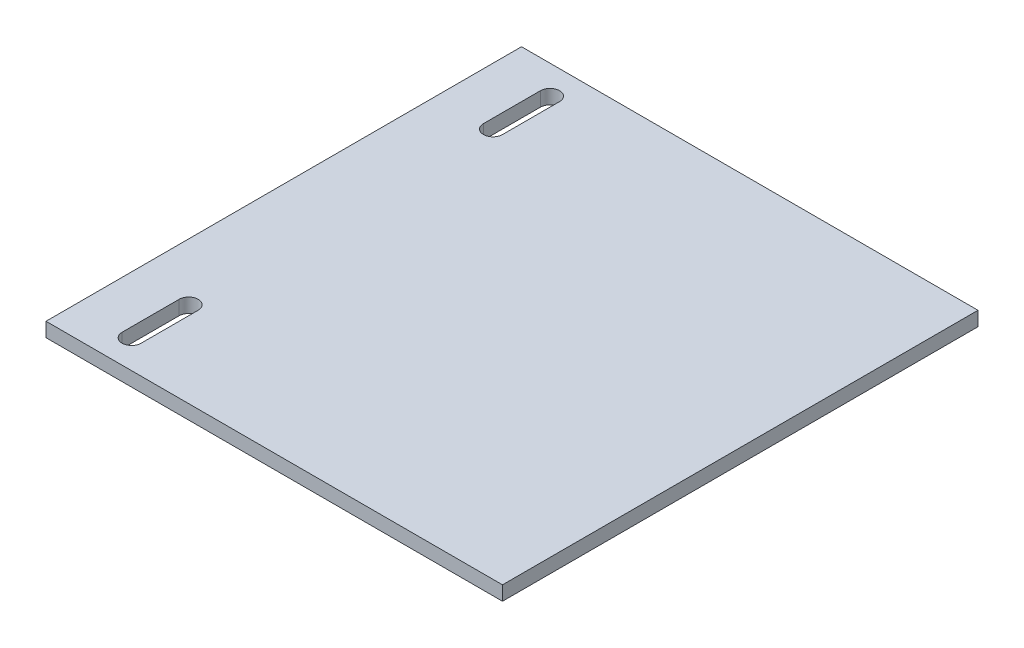
ISO-10303-21;
HEADER;
FILE_DESCRIPTION(('STEP AP214'),'2;1');
FILE_NAME('part.step','',(''),(''),'','','');
FILE_SCHEMA(('AUTOMOTIVE_DESIGN { 1 0 10303 214 1 1 1 1 }'));
ENDSEC;
DATA;
#1=APPLICATION_CONTEXT('core data for automotive mechanical design processes');
#2=APPLICATION_PROTOCOL_DEFINITION('international standard','automotive_design',2000,#1);
#3=PRODUCT_CONTEXT('',#1,'mechanical');
#4=PRODUCT('Part','Part','',(#3));
#5=PRODUCT_RELATED_PRODUCT_CATEGORY('part','',(#4));
#6=PRODUCT_DEFINITION_FORMATION('','',#4);
#7=PRODUCT_DEFINITION_CONTEXT('part definition',#1,'design');
#8=PRODUCT_DEFINITION('design','',#6,#7);
#9=PRODUCT_DEFINITION_SHAPE('','',#8);
#10=(LENGTH_UNIT() NAMED_UNIT(*) SI_UNIT(.MILLI.,.METRE.));
#11=(NAMED_UNIT(*) PLANE_ANGLE_UNIT() SI_UNIT($,.RADIAN.));
#12=(NAMED_UNIT(*) SI_UNIT($,.STERADIAN.) SOLID_ANGLE_UNIT());
#13=UNCERTAINTY_MEASURE_WITH_UNIT(LENGTH_MEASURE(1.E-05),#10,'distance_accuracy_value','');
#14=(GEOMETRIC_REPRESENTATION_CONTEXT(3) GLOBAL_UNCERTAINTY_ASSIGNED_CONTEXT((#13)) GLOBAL_UNIT_ASSIGNED_CONTEXT((#10,
#11,#12)) REPRESENTATION_CONTEXT('',''));
#15=CARTESIAN_POINT('',(0.,0.,0.));
#16=DIRECTION('',(0.,0.,1.));
#17=DIRECTION('',(1.,0.,0.));
#18=AXIS2_PLACEMENT_3D('',#15,#16,#17);
#19=CARTESIAN_POINT('',(-76.2,4.7625,-79.375));
#20=DIRECTION('',(1.,0.,0.));
#21=DIRECTION('',(0.,0.,-1.));
#22=AXIS2_PLACEMENT_3D('',#19,#20,#21);
#23=PLANE('',#22);
#24=DIRECTION('',(0.,0.,1.));
#25=VECTOR('',#24,1.);
#26=CARTESIAN_POINT('',(-76.2,0.,-79.375));
#27=LINE('',#26,#25);
#28=CARTESIAN_POINT('',(-76.2,0.,-79.375));
#29=VERTEX_POINT('',#28);
#30=CARTESIAN_POINT('',(-76.2,0.,79.375));
#31=VERTEX_POINT('',#30);
#32=EDGE_CURVE('E209',#29,#31,#27,.T.);
#33=ORIENTED_EDGE('',*,*,#32,.T.);
#34=DIRECTION('',(0.,-1.,0.));
#35=VECTOR('',#34,1.);
#36=CARTESIAN_POINT('',(-76.2,4.7625,79.375));
#37=LINE('',#36,#35);
#38=CARTESIAN_POINT('',(-76.2,4.7625,79.375));
#39=VERTEX_POINT('',#38);
#40=EDGE_CURVE('E11',#39,#31,#37,.T.);
#41=ORIENTED_EDGE('',*,*,#40,.F.);
#42=DIRECTION('',(0.,0.,1.));
#43=VECTOR('',#42,1.);
#44=CARTESIAN_POINT('',(-76.2,4.7625,-79.375));
#45=LINE('',#44,#43);
#46=CARTESIAN_POINT('',(-76.2,4.7625,-79.375));
#47=VERTEX_POINT('',#46);
#48=EDGE_CURVE('E219',#47,#39,#45,.T.);
#49=ORIENTED_EDGE('',*,*,#48,.F.);
#50=DIRECTION('',(0.,-1.,0.));
#51=VECTOR('',#50,1.);
#52=CARTESIAN_POINT('',(-76.2,4.7625,-79.375));
#53=LINE('',#52,#51);
#54=EDGE_CURVE('E233',#47,#29,#53,.T.);
#55=ORIENTED_EDGE('',*,*,#54,.T.);
#56=EDGE_LOOP('',(#33,#41,#49,#55));
#57=FACE_BOUND('',#56,.T.);
#58=ADVANCED_FACE('F41',(#57),#23,.F.);
#59=CARTESIAN_POINT('',(76.2,4.7625,79.375));
#60=DIRECTION('',(0.,0.,-1.));
#61=DIRECTION('',(-1.,0.,0.));
#62=AXIS2_PLACEMENT_3D('',#59,#60,#61);
#63=PLANE('',#62);
#64=DIRECTION('',(1.,0.,0.));
#65=VECTOR('',#64,1.);
#66=CARTESIAN_POINT('',(76.2,0.,79.375));
#67=LINE('',#66,#65);
#68=CARTESIAN_POINT('',(76.2,0.,79.375));
#69=VERTEX_POINT('',#68);
#70=EDGE_CURVE('E237',#31,#69,#67,.T.);
#71=ORIENTED_EDGE('',*,*,#70,.T.);
#72=DIRECTION('',(0.,-1.,0.));
#73=VECTOR('',#72,1.);
#74=CARTESIAN_POINT('',(76.2,4.7625,79.375));
#75=LINE('',#74,#73);
#76=CARTESIAN_POINT('',(76.2,4.7625,79.375));
#77=VERTEX_POINT('',#76);
#78=EDGE_CURVE('E48',#77,#69,#75,.T.);
#79=ORIENTED_EDGE('',*,*,#78,.F.);
#80=DIRECTION('',(1.,0.,0.));
#81=VECTOR('',#80,1.);
#82=CARTESIAN_POINT('',(76.2,4.7625,79.375));
#83=LINE('',#82,#81);
#84=EDGE_CURVE('E223',#39,#77,#83,.T.);
#85=ORIENTED_EDGE('',*,*,#84,.F.);
#86=ORIENTED_EDGE('',*,*,#40,.T.);
#87=EDGE_LOOP('',(#71,#79,#85,#86));
#88=FACE_BOUND('',#87,.T.);
#89=ADVANCED_FACE('F269',(#88),#63,.F.);
#90=CARTESIAN_POINT('',(76.2,4.7625,-79.375));
#91=DIRECTION('',(-1.,0.,0.));
#92=DIRECTION('',(0.,0.,1.));
#93=AXIS2_PLACEMENT_3D('',#90,#91,#92);
#94=PLANE('',#93);
#95=DIRECTION('',(0.,0.,-1.));
#96=VECTOR('',#95,1.);
#97=CARTESIAN_POINT('',(76.2,0.,-79.375));
#98=LINE('',#97,#96);
#99=CARTESIAN_POINT('',(76.2,0.,-79.375));
#100=VERTEX_POINT('',#99);
#101=EDGE_CURVE('E239',#69,#100,#98,.T.);
#102=ORIENTED_EDGE('',*,*,#101,.T.);
#103=DIRECTION('',(0.,-1.,0.));
#104=VECTOR('',#103,1.);
#105=CARTESIAN_POINT('',(76.2,4.7625,-79.375));
#106=LINE('',#105,#104);
#107=CARTESIAN_POINT('',(76.2,4.7625,-79.375));
#108=VERTEX_POINT('',#107);
#109=EDGE_CURVE('E247',#108,#100,#106,.T.);
#110=ORIENTED_EDGE('',*,*,#109,.F.);
#111=DIRECTION('',(0.,0.,-1.));
#112=VECTOR('',#111,1.);
#113=CARTESIAN_POINT('',(76.2,4.7625,-79.375));
#114=LINE('',#113,#112);
#115=EDGE_CURVE('E227',#77,#108,#114,.T.);
#116=ORIENTED_EDGE('',*,*,#115,.F.);
#117=ORIENTED_EDGE('',*,*,#78,.T.);
#118=EDGE_LOOP('',(#102,#110,#116,#117));
#119=FACE_BOUND('',#118,.T.);
#120=ADVANCED_FACE('F254',(#119),#94,.F.);
#121=CARTESIAN_POINT('',(76.2,4.7625,-79.375));
#122=DIRECTION('',(0.,0.,1.));
#123=DIRECTION('',(1.,0.,0.));
#124=AXIS2_PLACEMENT_3D('',#121,#122,#123);
#125=PLANE('',#124);
#126=DIRECTION('',(-1.,0.,0.));
#127=VECTOR('',#126,1.);
#128=CARTESIAN_POINT('',(76.2,0.,-79.375));
#129=LINE('',#128,#127);
#130=EDGE_CURVE('E224',#100,#29,#129,.T.);
#131=ORIENTED_EDGE('',*,*,#130,.T.);
#132=ORIENTED_EDGE('',*,*,#54,.F.);
#133=DIRECTION('',(-1.,0.,0.));
#134=VECTOR('',#133,1.);
#135=CARTESIAN_POINT('',(76.2,4.7625,-79.375));
#136=LINE('',#135,#134);
#137=EDGE_CURVE('E230',#108,#47,#136,.T.);
#138=ORIENTED_EDGE('',*,*,#137,.F.);
#139=ORIENTED_EDGE('',*,*,#109,.T.);
#140=EDGE_LOOP('',(#131,#132,#138,#139));
#141=FACE_BOUND('',#140,.T.);
#142=ADVANCED_FACE('F262',(#141),#125,.F.);
#143=CARTESIAN_POINT('',(-76.2,4.7625,79.375));
#144=DIRECTION('',(0.,-1.,0.));
#145=DIRECTION('',(0.,0.,-1.));
#146=AXIS2_PLACEMENT_3D('',#143,#144,#145);
#147=PLANE('',#146);
#148=CARTESIAN_POINT('',(-57.15,4.7625,69.85));
#149=DIRECTION('',(0.,1.,0.));
#150=DIRECTION('',(0.,0.,1.));
#151=AXIS2_PLACEMENT_3D('',#148,#149,#150);
#152=CIRCLE('',#151,3.175);
#153=CARTESIAN_POINT('',(-60.3250000000001,4.7625,69.85));
#154=VERTEX_POINT('',#153);
#155=CARTESIAN_POINT('',(-53.975,4.7625,69.85));
#156=VERTEX_POINT('',#155);
#157=EDGE_CURVE('E165',#154,#156,#152,.T.);
#158=ORIENTED_EDGE('',*,*,#157,.F.);
#159=DIRECTION('',(0.,0.,1.));
#160=VECTOR('',#159,1.);
#161=CARTESIAN_POINT('',(-60.3250000000001,4.7625,0.));
#162=LINE('',#161,#160);
#163=CARTESIAN_POINT('',(-60.325,4.7625,50.8));
#164=VERTEX_POINT('',#163);
#165=EDGE_CURVE('E55',#164,#154,#162,.T.);
#166=ORIENTED_EDGE('',*,*,#165,.F.);
#167=CARTESIAN_POINT('',(-57.1500000000001,4.7625,50.8));
#168=DIRECTION('',(0.,1.,0.));
#169=DIRECTION('',(0.,0.,1.));
#170=AXIS2_PLACEMENT_3D('',#167,#168,#169);
#171=CIRCLE('',#170,3.175);
#172=CARTESIAN_POINT('',(-53.975,4.7625,50.8));
#173=VERTEX_POINT('',#172);
#174=EDGE_CURVE('E156',#173,#164,#171,.T.);
#175=ORIENTED_EDGE('',*,*,#174,.F.);
#176=DIRECTION('',(0.,0.,1.));
#177=VECTOR('',#176,1.);
#178=CARTESIAN_POINT('',(-53.9750000000001,4.7625,0.));
#179=LINE('',#178,#177);
#180=EDGE_CURVE('E159',#173,#156,#179,.T.);
#181=ORIENTED_EDGE('',*,*,#180,.T.);
#182=EDGE_LOOP('',(#158,#166,#175,#181));
#183=FACE_BOUND('',#182,.T.);
#184=CARTESIAN_POINT('',(-57.1500000000001,4.7625,-69.85));
#185=DIRECTION('',(0.,1.,0.));
#186=DIRECTION('',(0.,0.,1.));
#187=AXIS2_PLACEMENT_3D('',#184,#185,#186);
#188=CIRCLE('',#187,3.175);
#189=CARTESIAN_POINT('',(-53.9750000000001,4.7625,-69.85));
#190=VERTEX_POINT('',#189);
#191=CARTESIAN_POINT('',(-60.3250000000001,4.7625,-69.85));
#192=VERTEX_POINT('',#191);
#193=EDGE_CURVE('E195',#190,#192,#188,.T.);
#194=ORIENTED_EDGE('',*,*,#193,.F.);
#195=DIRECTION('',(0.,0.,-1.));
#196=VECTOR('',#195,1.);
#197=CARTESIAN_POINT('',(-53.975,4.7625,0.));
#198=LINE('',#197,#196);
#199=CARTESIAN_POINT('',(-53.9750000000001,4.7625,-50.8));
#200=VERTEX_POINT('',#199);
#201=EDGE_CURVE('E171',#200,#190,#198,.T.);
#202=ORIENTED_EDGE('',*,*,#201,.F.);
#203=CARTESIAN_POINT('',(-57.15,4.7625,-50.8));
#204=DIRECTION('',(0.,1.,0.));
#205=DIRECTION('',(0.,0.,1.));
#206=AXIS2_PLACEMENT_3D('',#203,#204,#205);
#207=CIRCLE('',#206,3.175);
#208=CARTESIAN_POINT('',(-60.3250000000001,4.7625,-50.8));
#209=VERTEX_POINT('',#208);
#210=EDGE_CURVE('E180',#209,#200,#207,.T.);
#211=ORIENTED_EDGE('',*,*,#210,.F.);
#212=DIRECTION('',(0.,0.,-1.));
#213=VECTOR('',#212,1.);
#214=CARTESIAN_POINT('',(-60.325,4.7625,0.));
#215=LINE('',#214,#213);
#216=EDGE_CURVE('E199',#209,#192,#215,.T.);
#217=ORIENTED_EDGE('',*,*,#216,.T.);
#218=EDGE_LOOP('',(#194,#202,#211,#217));
#219=FACE_BOUND('',#218,.T.);
#220=ORIENTED_EDGE('',*,*,#48,.T.);
#221=ORIENTED_EDGE('',*,*,#84,.T.);
#222=ORIENTED_EDGE('',*,*,#115,.T.);
#223=ORIENTED_EDGE('',*,*,#137,.T.);
#224=EDGE_LOOP('',(#220,#221,#222,#223));
#225=FACE_BOUND('',#224,.T.);
#226=ADVANCED_FACE('F268',(#183,#219,#225),#147,.F.);
#227=CARTESIAN_POINT('',(-76.2,0.,79.375));
#228=DIRECTION('',(0.,-1.,0.));
#229=DIRECTION('',(0.,0.,-1.));
#230=AXIS2_PLACEMENT_3D('',#227,#228,#229);
#231=PLANE('',#230);
#232=DIRECTION('',(0.,0.,1.));
#233=VECTOR('',#232,1.);
#234=CARTESIAN_POINT('',(-60.3250000000001,0.,0.));
#235=LINE('',#234,#233);
#236=CARTESIAN_POINT('',(-60.325,0.,50.8));
#237=VERTEX_POINT('',#236);
#238=CARTESIAN_POINT('',(-60.325,0.,69.85));
#239=VERTEX_POINT('',#238);
#240=EDGE_CURVE('E141',#237,#239,#235,.T.);
#241=ORIENTED_EDGE('',*,*,#240,.T.);
#242=CARTESIAN_POINT('',(-57.15,0.,69.85));
#243=DIRECTION('',(0.,1.,0.));
#244=DIRECTION('',(0.,0.,1.));
#245=AXIS2_PLACEMENT_3D('',#242,#243,#244);
#246=CIRCLE('',#245,3.175);
#247=CARTESIAN_POINT('',(-53.975,0.,69.85));
#248=VERTEX_POINT('',#247);
#249=EDGE_CURVE('E147',#239,#248,#246,.T.);
#250=ORIENTED_EDGE('',*,*,#249,.T.);
#251=DIRECTION('',(0.,0.,1.));
#252=VECTOR('',#251,1.);
#253=CARTESIAN_POINT('',(-53.9750000000001,0.,0.));
#254=LINE('',#253,#252);
#255=CARTESIAN_POINT('',(-53.975,0.,50.8));
#256=VERTEX_POINT('',#255);
#257=EDGE_CURVE('E151',#256,#248,#254,.T.);
#258=ORIENTED_EDGE('',*,*,#257,.F.);
#259=CARTESIAN_POINT('',(-57.1500000000001,0.,50.8));
#260=DIRECTION('',(0.,1.,0.));
#261=DIRECTION('',(0.,0.,1.));
#262=AXIS2_PLACEMENT_3D('',#259,#260,#261);
#263=CIRCLE('',#262,3.175);
#264=EDGE_CURVE('E144',#256,#237,#263,.T.);
#265=ORIENTED_EDGE('',*,*,#264,.T.);
#266=EDGE_LOOP('',(#241,#250,#258,#265));
#267=FACE_BOUND('',#266,.T.);
#268=DIRECTION('',(0.,0.,-1.));
#269=VECTOR('',#268,1.);
#270=CARTESIAN_POINT('',(-53.975,0.,0.));
#271=LINE('',#270,#269);
#272=CARTESIAN_POINT('',(-53.9750000000001,0.,-50.8));
#273=VERTEX_POINT('',#272);
#274=CARTESIAN_POINT('',(-53.9750000000001,0.,-69.85));
#275=VERTEX_POINT('',#274);
#276=EDGE_CURVE('E175',#273,#275,#271,.T.);
#277=ORIENTED_EDGE('',*,*,#276,.T.);
#278=CARTESIAN_POINT('',(-57.1500000000001,0.,-69.85));
#279=DIRECTION('',(0.,1.,0.));
#280=DIRECTION('',(0.,0.,1.));
#281=AXIS2_PLACEMENT_3D('',#278,#279,#280);
#282=CIRCLE('',#281,3.175);
#283=CARTESIAN_POINT('',(-60.3250000000001,0.,-69.85));
#284=VERTEX_POINT('',#283);
#285=EDGE_CURVE('E179',#275,#284,#282,.T.);
#286=ORIENTED_EDGE('',*,*,#285,.T.);
#287=DIRECTION('',(0.,0.,-1.));
#288=VECTOR('',#287,1.);
#289=CARTESIAN_POINT('',(-60.325,0.,0.));
#290=LINE('',#289,#288);
#291=CARTESIAN_POINT('',(-60.3250000000001,0.,-50.8));
#292=VERTEX_POINT('',#291);
#293=EDGE_CURVE('E184',#292,#284,#290,.T.);
#294=ORIENTED_EDGE('',*,*,#293,.F.);
#295=CARTESIAN_POINT('',(-57.15,0.,-50.8));
#296=DIRECTION('',(0.,1.,0.));
#297=DIRECTION('',(0.,0.,1.));
#298=AXIS2_PLACEMENT_3D('',#295,#296,#297);
#299=CIRCLE('',#298,3.175);
#300=EDGE_CURVE('E188',#292,#273,#299,.T.);
#301=ORIENTED_EDGE('',*,*,#300,.T.);
#302=EDGE_LOOP('',(#277,#286,#294,#301));
#303=FACE_BOUND('',#302,.T.);
#304=ORIENTED_EDGE('',*,*,#32,.F.);
#305=ORIENTED_EDGE('',*,*,#130,.F.);
#306=ORIENTED_EDGE('',*,*,#101,.F.);
#307=ORIENTED_EDGE('',*,*,#70,.F.);
#308=EDGE_LOOP('',(#304,#305,#306,#307));
#309=FACE_BOUND('',#308,.T.);
#310=ADVANCED_FACE('F153',(#267,#303,#309),#231,.T.);
#311=CARTESIAN_POINT('',(-53.975,0.,0.));
#312=DIRECTION('',(1.,0.,0.));
#313=DIRECTION('',(0.,0.,-1.));
#314=AXIS2_PLACEMENT_3D('',#311,#312,#313);
#315=PLANE('',#314);
#316=ORIENTED_EDGE('',*,*,#201,.T.);
#317=DIRECTION('',(0.,1.,0.));
#318=VECTOR('',#317,1.);
#319=CARTESIAN_POINT('',(-53.9750000000001,0.,-69.85));
#320=LINE('',#319,#318);
#321=EDGE_CURVE('E192',#275,#190,#320,.T.);
#322=ORIENTED_EDGE('',*,*,#321,.F.);
#323=ORIENTED_EDGE('',*,*,#276,.F.);
#324=DIRECTION('',(0.,1.,0.));
#325=VECTOR('',#324,1.);
#326=CARTESIAN_POINT('',(-53.9750000000001,0.,-50.8));
#327=LINE('',#326,#325);
#328=EDGE_CURVE('E206',#273,#200,#327,.T.);
#329=ORIENTED_EDGE('',*,*,#328,.T.);
#330=EDGE_LOOP('',(#316,#322,#323,#329));
#331=FACE_BOUND('',#330,.T.);
#332=ADVANCED_FACE('F281',(#331),#315,.F.);
#333=CARTESIAN_POINT('',(-57.15,0.,-50.8));
#334=DIRECTION('',(0.,1.,0.));
#335=DIRECTION('',(0.,0.,1.));
#336=AXIS2_PLACEMENT_3D('',#333,#334,#335);
#337=CYLINDRICAL_SURFACE('',#336,3.175);
#338=ORIENTED_EDGE('',*,*,#210,.T.);
#339=ORIENTED_EDGE('',*,*,#328,.F.);
#340=ORIENTED_EDGE('',*,*,#300,.F.);
#341=DIRECTION('',(0.,1.,0.));
#342=VECTOR('',#341,1.);
#343=CARTESIAN_POINT('',(-60.3250000000001,0.,-50.8));
#344=LINE('',#343,#342);
#345=EDGE_CURVE('E210',#292,#209,#344,.T.);
#346=ORIENTED_EDGE('',*,*,#345,.T.);
#347=EDGE_LOOP('',(#338,#339,#340,#346));
#348=FACE_BOUND('',#347,.T.);
#349=ADVANCED_FACE('F287',(#348),#337,.F.);
#350=CARTESIAN_POINT('',(-60.325,0.,0.));
#351=DIRECTION('',(1.,0.,0.));
#352=DIRECTION('',(0.,0.,-1.));
#353=AXIS2_PLACEMENT_3D('',#350,#351,#352);
#354=PLANE('',#353);
#355=ORIENTED_EDGE('',*,*,#216,.F.);
#356=ORIENTED_EDGE('',*,*,#345,.F.);
#357=ORIENTED_EDGE('',*,*,#293,.T.);
#358=DIRECTION('',(0.,1.,0.));
#359=VECTOR('',#358,1.);
#360=CARTESIAN_POINT('',(-60.3250000000001,0.,-69.85));
#361=LINE('',#360,#359);
#362=EDGE_CURVE('E213',#284,#192,#361,.T.);
#363=ORIENTED_EDGE('',*,*,#362,.T.);
#364=EDGE_LOOP('',(#355,#356,#357,#363));
#365=FACE_BOUND('',#364,.T.);
#366=ADVANCED_FACE('F292',(#365),#354,.T.);
#367=CARTESIAN_POINT('',(-57.1500000000001,0.,-69.85));
#368=DIRECTION('',(0.,1.,0.));
#369=DIRECTION('',(0.,0.,1.));
#370=AXIS2_PLACEMENT_3D('',#367,#368,#369);
#371=CYLINDRICAL_SURFACE('',#370,3.175);
#372=ORIENTED_EDGE('',*,*,#193,.T.);
#373=ORIENTED_EDGE('',*,*,#362,.F.);
#374=ORIENTED_EDGE('',*,*,#285,.F.);
#375=ORIENTED_EDGE('',*,*,#321,.T.);
#376=EDGE_LOOP('',(#372,#373,#374,#375));
#377=FACE_BOUND('',#376,.T.);
#378=ADVANCED_FACE('F289',(#377),#371,.F.);
#379=CARTESIAN_POINT('',(-60.3250000000001,0.,0.));
#380=DIRECTION('',(-1.,0.,0.));
#381=DIRECTION('',(0.,0.,1.));
#382=AXIS2_PLACEMENT_3D('',#379,#380,#381);
#383=PLANE('',#382);
#384=ORIENTED_EDGE('',*,*,#165,.T.);
#385=DIRECTION('',(0.,1.,0.));
#386=VECTOR('',#385,1.);
#387=CARTESIAN_POINT('',(-60.325,0.,69.85));
#388=LINE('',#387,#386);
#389=EDGE_CURVE('E138',#239,#154,#388,.T.);
#390=ORIENTED_EDGE('',*,*,#389,.F.);
#391=ORIENTED_EDGE('',*,*,#240,.F.);
#392=DIRECTION('',(0.,1.,0.));
#393=VECTOR('',#392,1.);
#394=CARTESIAN_POINT('',(-60.325,0.,50.8));
#395=LINE('',#394,#393);
#396=EDGE_CURVE('E169',#237,#164,#395,.T.);
#397=ORIENTED_EDGE('',*,*,#396,.T.);
#398=EDGE_LOOP('',(#384,#390,#391,#397));
#399=FACE_BOUND('',#398,.T.);
#400=ADVANCED_FACE('F139',(#399),#383,.F.);
#401=CARTESIAN_POINT('',(-57.1500000000001,0.,50.8));
#402=DIRECTION('',(0.,1.,0.));
#403=DIRECTION('',(0.,0.,1.));
#404=AXIS2_PLACEMENT_3D('',#401,#402,#403);
#405=CYLINDRICAL_SURFACE('',#404,3.175);
#406=ORIENTED_EDGE('',*,*,#174,.T.);
#407=ORIENTED_EDGE('',*,*,#396,.F.);
#408=ORIENTED_EDGE('',*,*,#264,.F.);
#409=DIRECTION('',(0.,1.,0.));
#410=VECTOR('',#409,1.);
#411=CARTESIAN_POINT('',(-53.975,0.,50.8));
#412=LINE('',#411,#410);
#413=EDGE_CURVE('E172',#256,#173,#412,.T.);
#414=ORIENTED_EDGE('',*,*,#413,.T.);
#415=EDGE_LOOP('',(#406,#407,#408,#414));
#416=FACE_BOUND('',#415,.T.);
#417=ADVANCED_FACE('F302',(#416),#405,.F.);
#418=CARTESIAN_POINT('',(-53.9750000000001,0.,0.));
#419=DIRECTION('',(-1.,0.,0.));
#420=DIRECTION('',(0.,0.,1.));
#421=AXIS2_PLACEMENT_3D('',#418,#419,#420);
#422=PLANE('',#421);
#423=ORIENTED_EDGE('',*,*,#180,.F.);
#424=ORIENTED_EDGE('',*,*,#413,.F.);
#425=ORIENTED_EDGE('',*,*,#257,.T.);
#426=DIRECTION('',(0.,1.,0.));
#427=VECTOR('',#426,1.);
#428=CARTESIAN_POINT('',(-53.975,0.,69.85));
#429=LINE('',#428,#427);
#430=EDGE_CURVE('E63',#248,#156,#429,.T.);
#431=ORIENTED_EDGE('',*,*,#430,.T.);
#432=EDGE_LOOP('',(#423,#424,#425,#431));
#433=FACE_BOUND('',#432,.T.);
#434=ADVANCED_FACE('F305',(#433),#422,.T.);
#435=CARTESIAN_POINT('',(-57.15,0.,69.85));
#436=DIRECTION('',(0.,1.,0.));
#437=DIRECTION('',(0.,0.,1.));
#438=AXIS2_PLACEMENT_3D('',#435,#436,#437);
#439=CYLINDRICAL_SURFACE('',#438,3.175);
#440=ORIENTED_EDGE('',*,*,#157,.T.);
#441=ORIENTED_EDGE('',*,*,#430,.F.);
#442=ORIENTED_EDGE('',*,*,#249,.F.);
#443=ORIENTED_EDGE('',*,*,#389,.T.);
#444=EDGE_LOOP('',(#440,#441,#442,#443));
#445=FACE_BOUND('',#444,.T.);
#446=ADVANCED_FACE('F148',(#445),#439,.F.);
#447=CLOSED_SHELL('',(#58,#89,#120,#142,#226,#310,#332,#349,#366,#378,#400,#417,#434,#446));
#448=MANIFOLD_SOLID_BREP('B2',#447);
#449=ADVANCED_BREP_SHAPE_REPRESENTATION('',(#18,#448),#14);
#450=SHAPE_DEFINITION_REPRESENTATION(#9,#449);
ENDSEC;
END-ISO-10303-21;
